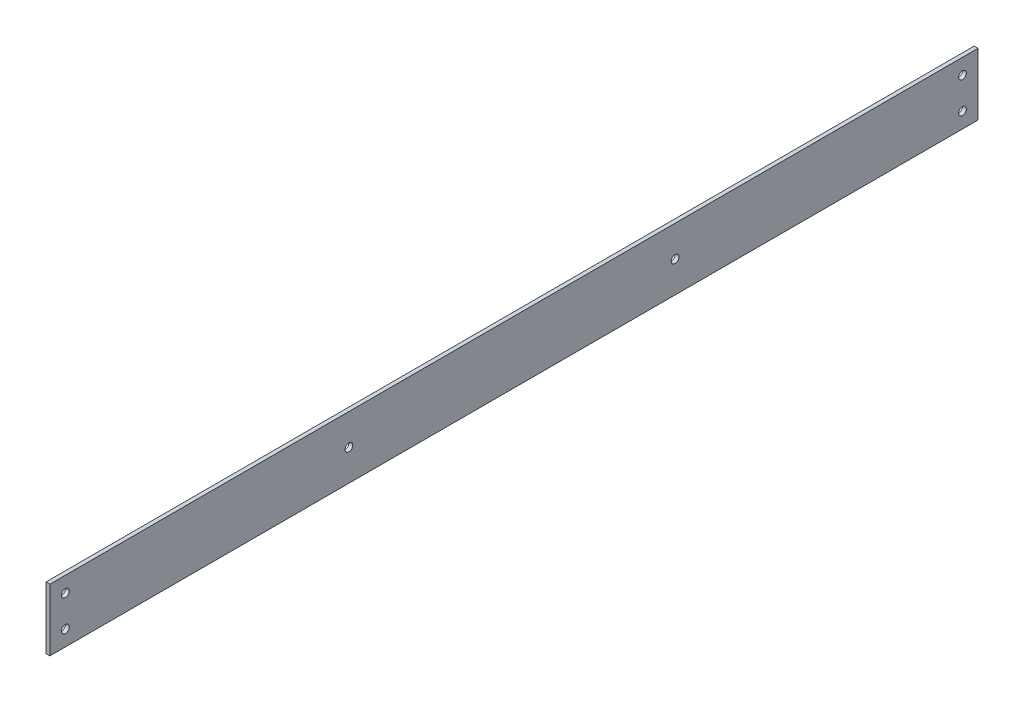
ISO-10303-21;
HEADER;
FILE_DESCRIPTION(('STEP AP214'),'2;1');
FILE_NAME('part.step','',(''),(''),'','','');
FILE_SCHEMA(('AUTOMOTIVE_DESIGN { 1 0 10303 214 1 1 1 1 }'));
ENDSEC;
DATA;
#1=APPLICATION_CONTEXT('core data for automotive mechanical design processes');
#2=APPLICATION_PROTOCOL_DEFINITION('international standard','automotive_design',2000,#1);
#3=PRODUCT_CONTEXT('',#1,'mechanical');
#4=PRODUCT('Part','Part','',(#3));
#5=PRODUCT_RELATED_PRODUCT_CATEGORY('part','',(#4));
#6=PRODUCT_DEFINITION_FORMATION('','',#4);
#7=PRODUCT_DEFINITION_CONTEXT('part definition',#1,'design');
#8=PRODUCT_DEFINITION('design','',#6,#7);
#9=PRODUCT_DEFINITION_SHAPE('','',#8);
#10=(LENGTH_UNIT() NAMED_UNIT(*) SI_UNIT(.MILLI.,.METRE.));
#11=(NAMED_UNIT(*) PLANE_ANGLE_UNIT() SI_UNIT($,.RADIAN.));
#12=(NAMED_UNIT(*) SI_UNIT($,.STERADIAN.) SOLID_ANGLE_UNIT());
#13=UNCERTAINTY_MEASURE_WITH_UNIT(LENGTH_MEASURE(1.E-05),#10,'distance_accuracy_value','');
#14=(GEOMETRIC_REPRESENTATION_CONTEXT(3) GLOBAL_UNCERTAINTY_ASSIGNED_CONTEXT((#13)) GLOBAL_UNIT_ASSIGNED_CONTEXT((#10,
#11,#12)) REPRESENTATION_CONTEXT('',''));
#15=CARTESIAN_POINT('',(0.,0.,0.));
#16=DIRECTION('',(0.,0.,1.));
#17=DIRECTION('',(1.,0.,0.));
#18=AXIS2_PLACEMENT_3D('',#15,#16,#17);
#19=CARTESIAN_POINT('',(1.5875,-25.4,809.625));
#20=DIRECTION('',(-1.,0.,0.));
#21=DIRECTION('',(0.,0.,1.));
#22=AXIS2_PLACEMENT_3D('',#19,#20,#21);
#23=PLANE('',#22);
#24=CARTESIAN_POINT('',(1.5875,0.,273.05));
#25=DIRECTION('',(-1.,0.,0.));
#26=DIRECTION('',(0.,0.,1.));
#27=AXIS2_PLACEMENT_3D('',#24,#25,#26);
#28=CIRCLE('',#27,3.17499999999997);
#29=CARTESIAN_POINT('',(1.5875,0.,276.225));
#30=VERTEX_POINT('',#29);
#31=EDGE_CURVE('E95',#30,#30,#28,.T.);
#32=ORIENTED_EDGE('',*,*,#31,.T.);
#33=EDGE_LOOP('',(#32));
#34=FACE_BOUND('',#33,.T.);
#35=CARTESIAN_POINT('',(1.5875,0.,539.75));
#36=DIRECTION('',(-1.,0.,0.));
#37=DIRECTION('',(0.,0.,1.));
#38=AXIS2_PLACEMENT_3D('',#35,#36,#37);
#39=CIRCLE('',#38,3.17499999999997);
#40=CARTESIAN_POINT('',(1.5875,0.,542.925));
#41=VERTEX_POINT('',#40);
#42=EDGE_CURVE('E162',#41,#41,#39,.T.);
#43=ORIENTED_EDGE('',*,*,#42,.T.);
#44=EDGE_LOOP('',(#43));
#45=FACE_BOUND('',#44,.T.);
#46=CARTESIAN_POINT('',(1.5875,-12.7,38.1));
#47=DIRECTION('',(1.,0.,0.));
#48=DIRECTION('',(0.,0.,-1.));
#49=AXIS2_PLACEMENT_3D('',#46,#47,#48);
#50=CIRCLE('',#49,3.175);
#51=CARTESIAN_POINT('',(1.5875,-12.7,34.925));
#52=VERTEX_POINT('',#51);
#53=EDGE_CURVE('E111',#52,#52,#50,.T.);
#54=ORIENTED_EDGE('',*,*,#53,.F.);
#55=EDGE_LOOP('',(#54));
#56=FACE_BOUND('',#55,.T.);
#57=CARTESIAN_POINT('',(1.5875,12.7,771.525));
#58=DIRECTION('',(1.,0.,0.));
#59=DIRECTION('',(0.,0.,1.));
#60=AXIS2_PLACEMENT_3D('',#57,#58,#59);
#61=CIRCLE('',#60,3.17500000000008);
#62=CARTESIAN_POINT('',(1.5875,12.7,774.7));
#63=VERTEX_POINT('',#62);
#64=EDGE_CURVE('E103',#63,#63,#61,.T.);
#65=ORIENTED_EDGE('',*,*,#64,.F.);
#66=EDGE_LOOP('',(#65));
#67=FACE_BOUND('',#66,.T.);
#68=CARTESIAN_POINT('',(1.5875,-12.7,771.525));
#69=DIRECTION('',(1.,0.,0.));
#70=DIRECTION('',(0.,0.,1.));
#71=AXIS2_PLACEMENT_3D('',#68,#69,#70);
#72=CIRCLE('',#71,3.17499999999986);
#73=CARTESIAN_POINT('',(1.5875,-12.7,774.7));
#74=VERTEX_POINT('',#73);
#75=EDGE_CURVE('E104',#74,#74,#72,.T.);
#76=ORIENTED_EDGE('',*,*,#75,.F.);
#77=EDGE_LOOP('',(#76));
#78=FACE_BOUND('',#77,.T.);
#79=CARTESIAN_POINT('',(1.5875,12.7,38.1));
#80=DIRECTION('',(1.,0.,0.));
#81=DIRECTION('',(0.,0.,-1.));
#82=AXIS2_PLACEMENT_3D('',#79,#80,#81);
#83=CIRCLE('',#82,3.175);
#84=CARTESIAN_POINT('',(1.5875,12.7,34.925));
#85=VERTEX_POINT('',#84);
#86=EDGE_CURVE('E110',#85,#85,#83,.T.);
#87=ORIENTED_EDGE('',*,*,#86,.F.);
#88=EDGE_LOOP('',(#87));
#89=FACE_BOUND('',#88,.T.);
#90=DIRECTION('',(0.,0.,-1.));
#91=VECTOR('',#90,1.);
#92=CARTESIAN_POINT('',(1.5875,25.4,809.625));
#93=LINE('',#92,#91);
#94=CARTESIAN_POINT('',(1.5875,25.4,784.225));
#95=VERTEX_POINT('',#94);
#96=CARTESIAN_POINT('',(1.5875,25.4,25.4));
#97=VERTEX_POINT('',#96);
#98=EDGE_CURVE('E11',#95,#97,#93,.T.);
#99=ORIENTED_EDGE('',*,*,#98,.F.);
#100=DIRECTION('',(0.,-1.,0.));
#101=VECTOR('',#100,1.);
#102=CARTESIAN_POINT('',(1.5875,-25.4,784.225));
#103=LINE('',#102,#101);
#104=CARTESIAN_POINT('',(1.5875,-25.4,784.225));
#105=VERTEX_POINT('',#104);
#106=EDGE_CURVE('E73',#95,#105,#103,.T.);
#107=ORIENTED_EDGE('',*,*,#106,.T.);
#108=DIRECTION('',(0.,0.,-1.));
#109=VECTOR('',#108,1.);
#110=CARTESIAN_POINT('',(1.5875,-25.4,809.625));
#111=LINE('',#110,#109);
#112=CARTESIAN_POINT('',(1.5875,-25.4,25.4));
#113=VERTEX_POINT('',#112);
#114=EDGE_CURVE('E89',#105,#113,#111,.T.);
#115=ORIENTED_EDGE('',*,*,#114,.T.);
#116=DIRECTION('',(0.,1.,0.));
#117=VECTOR('',#116,1.);
#118=CARTESIAN_POINT('',(1.5875,-25.4,25.4));
#119=LINE('',#118,#117);
#120=EDGE_CURVE('E57',#113,#97,#119,.T.);
#121=ORIENTED_EDGE('',*,*,#120,.T.);
#122=EDGE_LOOP('',(#99,#107,#115,#121));
#123=FACE_BOUND('',#122,.T.);
#124=ADVANCED_FACE('F35',(#34,#45,#56,#67,#78,#89,#123),#23,.F.);
#125=CARTESIAN_POINT('',(-1.5875,25.4,809.625));
#126=DIRECTION('',(0.,-1.,0.));
#127=DIRECTION('',(0.,0.,-1.));
#128=AXIS2_PLACEMENT_3D('',#125,#126,#127);
#129=PLANE('',#128);
#130=DIRECTION('',(0.,0.,-1.));
#131=VECTOR('',#130,1.);
#132=CARTESIAN_POINT('',(-1.5875,25.4,809.625));
#133=LINE('',#132,#131);
#134=CARTESIAN_POINT('',(-1.5875,25.4,784.225));
#135=VERTEX_POINT('',#134);
#136=CARTESIAN_POINT('',(-1.5875,25.4,25.4));
#137=VERTEX_POINT('',#136);
#138=EDGE_CURVE('E42',#135,#137,#133,.T.);
#139=ORIENTED_EDGE('',*,*,#138,.F.);
#140=DIRECTION('',(-1.,0.,0.));
#141=VECTOR('',#140,1.);
#142=CARTESIAN_POINT('',(1.5875,25.4,784.225));
#143=LINE('',#142,#141);
#144=EDGE_CURVE('E76',#95,#135,#143,.T.);
#145=ORIENTED_EDGE('',*,*,#144,.F.);
#146=ORIENTED_EDGE('',*,*,#98,.T.);
#147=DIRECTION('',(-1.,0.,0.));
#148=VECTOR('',#147,1.);
#149=CARTESIAN_POINT('',(1.5875,25.4,25.4));
#150=LINE('',#149,#148);
#151=EDGE_CURVE('E93',#97,#137,#150,.T.);
#152=ORIENTED_EDGE('',*,*,#151,.T.);
#153=EDGE_LOOP('',(#139,#145,#146,#152));
#154=FACE_BOUND('',#153,.T.);
#155=ADVANCED_FACE('F85',(#154),#129,.F.);
#156=CARTESIAN_POINT('',(-1.5875,-25.4,809.625));
#157=DIRECTION('',(1.,0.,0.));
#158=DIRECTION('',(0.,0.,-1.));
#159=AXIS2_PLACEMENT_3D('',#156,#157,#158);
#160=PLANE('',#159);
#161=CARTESIAN_POINT('',(-1.5875,0.,273.05));
#162=DIRECTION('',(-1.,0.,0.));
#163=DIRECTION('',(0.,0.,1.));
#164=AXIS2_PLACEMENT_3D('',#161,#162,#163);
#165=CIRCLE('',#164,3.17499999999997);
#166=CARTESIAN_POINT('',(-1.5875,0.,276.225));
#167=VERTEX_POINT('',#166);
#168=EDGE_CURVE('E193',#167,#167,#165,.T.);
#169=ORIENTED_EDGE('',*,*,#168,.F.);
#170=EDGE_LOOP('',(#169));
#171=FACE_BOUND('',#170,.T.);
#172=CARTESIAN_POINT('',(-1.5875,0.,539.75));
#173=DIRECTION('',(-1.,0.,0.));
#174=DIRECTION('',(0.,0.,1.));
#175=AXIS2_PLACEMENT_3D('',#172,#173,#174);
#176=CIRCLE('',#175,3.17499999999997);
#177=CARTESIAN_POINT('',(-1.5875,0.,542.925));
#178=VERTEX_POINT('',#177);
#179=EDGE_CURVE('E197',#178,#178,#176,.T.);
#180=ORIENTED_EDGE('',*,*,#179,.F.);
#181=EDGE_LOOP('',(#180));
#182=FACE_BOUND('',#181,.T.);
#183=CARTESIAN_POINT('',(-1.5875,-12.7,38.1));
#184=DIRECTION('',(1.,0.,0.));
#185=DIRECTION('',(0.,0.,-1.));
#186=AXIS2_PLACEMENT_3D('',#183,#184,#185);
#187=CIRCLE('',#186,3.175);
#188=CARTESIAN_POINT('',(-1.5875,-12.7,34.925));
#189=VERTEX_POINT('',#188);
#190=EDGE_CURVE('E107',#189,#189,#187,.T.);
#191=ORIENTED_EDGE('',*,*,#190,.T.);
#192=EDGE_LOOP('',(#191));
#193=FACE_BOUND('',#192,.T.);
#194=CARTESIAN_POINT('',(-1.5875,12.7,771.525));
#195=DIRECTION('',(1.,0.,0.));
#196=DIRECTION('',(0.,0.,1.));
#197=AXIS2_PLACEMENT_3D('',#194,#195,#196);
#198=CIRCLE('',#197,3.17500000000008);
#199=CARTESIAN_POINT('',(-1.5875,12.7,774.7));
#200=VERTEX_POINT('',#199);
#201=EDGE_CURVE('E114',#200,#200,#198,.T.);
#202=ORIENTED_EDGE('',*,*,#201,.T.);
#203=EDGE_LOOP('',(#202));
#204=FACE_BOUND('',#203,.T.);
#205=CARTESIAN_POINT('',(-1.5875,-12.7,771.525));
#206=DIRECTION('',(1.,0.,0.));
#207=DIRECTION('',(0.,0.,1.));
#208=AXIS2_PLACEMENT_3D('',#205,#206,#207);
#209=CIRCLE('',#208,3.17499999999986);
#210=CARTESIAN_POINT('',(-1.5875,-12.7,774.7));
#211=VERTEX_POINT('',#210);
#212=EDGE_CURVE('E100',#211,#211,#209,.T.);
#213=ORIENTED_EDGE('',*,*,#212,.T.);
#214=EDGE_LOOP('',(#213));
#215=FACE_BOUND('',#214,.T.);
#216=CARTESIAN_POINT('',(-1.5875,12.7,38.1));
#217=DIRECTION('',(1.,0.,0.));
#218=DIRECTION('',(0.,0.,-1.));
#219=AXIS2_PLACEMENT_3D('',#216,#217,#218);
#220=CIRCLE('',#219,3.175);
#221=CARTESIAN_POINT('',(-1.5875,12.7,34.925));
#222=VERTEX_POINT('',#221);
#223=EDGE_CURVE('E119',#222,#222,#220,.T.);
#224=ORIENTED_EDGE('',*,*,#223,.T.);
#225=EDGE_LOOP('',(#224));
#226=FACE_BOUND('',#225,.T.);
#227=DIRECTION('',(0.,0.,-1.));
#228=VECTOR('',#227,1.);
#229=CARTESIAN_POINT('',(-1.5875,-25.4,809.625));
#230=LINE('',#229,#228);
#231=CARTESIAN_POINT('',(-1.5875,-25.4,784.225));
#232=VERTEX_POINT('',#231);
#233=CARTESIAN_POINT('',(-1.5875,-25.4,25.4));
#234=VERTEX_POINT('',#233);
#235=EDGE_CURVE('E125',#232,#234,#230,.T.);
#236=ORIENTED_EDGE('',*,*,#235,.F.);
#237=DIRECTION('',(0.,-1.,0.));
#238=VECTOR('',#237,1.);
#239=CARTESIAN_POINT('',(-1.5875,-25.4,784.225));
#240=LINE('',#239,#238);
#241=EDGE_CURVE('E49',#135,#232,#240,.T.);
#242=ORIENTED_EDGE('',*,*,#241,.F.);
#243=ORIENTED_EDGE('',*,*,#138,.T.);
#244=DIRECTION('',(0.,1.,0.));
#245=VECTOR('',#244,1.);
#246=CARTESIAN_POINT('',(-1.5875,-25.4,25.4));
#247=LINE('',#246,#245);
#248=EDGE_CURVE('E91',#234,#137,#247,.T.);
#249=ORIENTED_EDGE('',*,*,#248,.F.);
#250=EDGE_LOOP('',(#236,#242,#243,#249));
#251=FACE_BOUND('',#250,.T.);
#252=ADVANCED_FACE('F130',(#171,#182,#193,#204,#215,#226,#251),#160,.F.);
#253=CARTESIAN_POINT('',(-1.5875,-25.4,809.625));
#254=DIRECTION('',(0.,1.,0.));
#255=DIRECTION('',(0.,0.,1.));
#256=AXIS2_PLACEMENT_3D('',#253,#254,#255);
#257=PLANE('',#256);
#258=ORIENTED_EDGE('',*,*,#114,.F.);
#259=DIRECTION('',(-1.,0.,0.));
#260=VECTOR('',#259,1.);
#261=CARTESIAN_POINT('',(1.5875,-25.4,784.225));
#262=LINE('',#261,#260);
#263=EDGE_CURVE('E77',#105,#232,#262,.T.);
#264=ORIENTED_EDGE('',*,*,#263,.T.);
#265=ORIENTED_EDGE('',*,*,#235,.T.);
#266=DIRECTION('',(-1.,0.,0.));
#267=VECTOR('',#266,1.);
#268=CARTESIAN_POINT('',(1.5875,-25.4,25.4));
#269=LINE('',#268,#267);
#270=EDGE_CURVE('E90',#113,#234,#269,.T.);
#271=ORIENTED_EDGE('',*,*,#270,.F.);
#272=EDGE_LOOP('',(#258,#264,#265,#271));
#273=FACE_BOUND('',#272,.T.);
#274=ADVANCED_FACE('F134',(#273),#257,.F.);
#275=CARTESIAN_POINT('',(-1.5875,12.7,38.1));
#276=DIRECTION('',(1.,0.,0.));
#277=DIRECTION('',(0.,0.,-1.));
#278=AXIS2_PLACEMENT_3D('',#275,#276,#277);
#279=CYLINDRICAL_SURFACE('',#278,3.175);
#280=ORIENTED_EDGE('',*,*,#223,.F.);
#281=EDGE_LOOP('',(#280));
#282=FACE_BOUND('',#281,.T.);
#283=ORIENTED_EDGE('',*,*,#86,.T.);
#284=EDGE_LOOP('',(#283));
#285=FACE_BOUND('',#284,.T.);
#286=ADVANCED_FACE('F171',(#282,#285),#279,.F.);
#287=CARTESIAN_POINT('',(-1.5875,-12.7,771.525));
#288=DIRECTION('',(1.,0.,0.));
#289=DIRECTION('',(0.,0.,-1.));
#290=AXIS2_PLACEMENT_3D('',#287,#288,#289);
#291=CYLINDRICAL_SURFACE('',#290,3.17499999999986);
#292=ORIENTED_EDGE('',*,*,#212,.F.);
#293=EDGE_LOOP('',(#292));
#294=FACE_BOUND('',#293,.T.);
#295=ORIENTED_EDGE('',*,*,#75,.T.);
#296=EDGE_LOOP('',(#295));
#297=FACE_BOUND('',#296,.T.);
#298=ADVANCED_FACE('F173',(#294,#297),#291,.F.);
#299=CARTESIAN_POINT('',(-1.5875,12.7,771.525));
#300=DIRECTION('',(1.,0.,0.));
#301=DIRECTION('',(0.,0.,-1.));
#302=AXIS2_PLACEMENT_3D('',#299,#300,#301);
#303=CYLINDRICAL_SURFACE('',#302,3.17500000000008);
#304=ORIENTED_EDGE('',*,*,#201,.F.);
#305=EDGE_LOOP('',(#304));
#306=FACE_BOUND('',#305,.T.);
#307=ORIENTED_EDGE('',*,*,#64,.T.);
#308=EDGE_LOOP('',(#307));
#309=FACE_BOUND('',#308,.T.);
#310=ADVANCED_FACE('F145',(#306,#309),#303,.F.);
#311=CARTESIAN_POINT('',(-1.5875,-12.7,38.1));
#312=DIRECTION('',(1.,0.,0.));
#313=DIRECTION('',(0.,0.,-1.));
#314=AXIS2_PLACEMENT_3D('',#311,#312,#313);
#315=CYLINDRICAL_SURFACE('',#314,3.175);
#316=ORIENTED_EDGE('',*,*,#190,.F.);
#317=EDGE_LOOP('',(#316));
#318=FACE_BOUND('',#317,.T.);
#319=ORIENTED_EDGE('',*,*,#53,.T.);
#320=EDGE_LOOP('',(#319));
#321=FACE_BOUND('',#320,.T.);
#322=ADVANCED_FACE('F137',(#318,#321),#315,.F.);
#323=CARTESIAN_POINT('',(1.5875,-25.4,25.4));
#324=DIRECTION('',(0.,0.,1.));
#325=DIRECTION('',(0.,-1.,0.));
#326=AXIS2_PLACEMENT_3D('',#323,#324,#325);
#327=PLANE('',#326);
#328=ORIENTED_EDGE('',*,*,#248,.T.);
#329=ORIENTED_EDGE('',*,*,#151,.F.);
#330=ORIENTED_EDGE('',*,*,#120,.F.);
#331=ORIENTED_EDGE('',*,*,#270,.T.);
#332=EDGE_LOOP('',(#328,#329,#330,#331));
#333=FACE_BOUND('',#332,.T.);
#334=ADVANCED_FACE('F135',(#333),#327,.F.);
#335=CARTESIAN_POINT('',(1.5875,-25.4,784.225));
#336=DIRECTION('',(0.,0.,-1.));
#337=DIRECTION('',(-1.,0.,0.));
#338=AXIS2_PLACEMENT_3D('',#335,#336,#337);
#339=PLANE('',#338);
#340=ORIENTED_EDGE('',*,*,#241,.T.);
#341=ORIENTED_EDGE('',*,*,#263,.F.);
#342=ORIENTED_EDGE('',*,*,#106,.F.);
#343=ORIENTED_EDGE('',*,*,#144,.T.);
#344=EDGE_LOOP('',(#340,#341,#342,#343));
#345=FACE_BOUND('',#344,.T.);
#346=ADVANCED_FACE('F75',(#345),#339,.F.);
#347=CARTESIAN_POINT('',(1.5875,0.,539.75));
#348=DIRECTION('',(-1.,0.,0.));
#349=DIRECTION('',(0.,0.,1.));
#350=AXIS2_PLACEMENT_3D('',#347,#348,#349);
#351=CYLINDRICAL_SURFACE('',#350,3.17499999999997);
#352=ORIENTED_EDGE('',*,*,#42,.F.);
#353=EDGE_LOOP('',(#352));
#354=FACE_BOUND('',#353,.T.);
#355=ORIENTED_EDGE('',*,*,#179,.T.);
#356=EDGE_LOOP('',(#355));
#357=FACE_BOUND('',#356,.T.);
#358=ADVANCED_FACE('F143',(#354,#357),#351,.F.);
#359=CARTESIAN_POINT('',(1.5875,0.,273.05));
#360=DIRECTION('',(-1.,0.,0.));
#361=DIRECTION('',(0.,0.,1.));
#362=AXIS2_PLACEMENT_3D('',#359,#360,#361);
#363=CYLINDRICAL_SURFACE('',#362,3.17499999999997);
#364=ORIENTED_EDGE('',*,*,#31,.F.);
#365=EDGE_LOOP('',(#364));
#366=FACE_BOUND('',#365,.T.);
#367=ORIENTED_EDGE('',*,*,#168,.T.);
#368=EDGE_LOOP('',(#367));
#369=FACE_BOUND('',#368,.T.);
#370=ADVANCED_FACE('F240',(#366,#369),#363,.F.);
#371=CLOSED_SHELL('',(#124,#155,#252,#274,#286,#298,#310,#322,#334,#346,#358,#370));
#372=MANIFOLD_SOLID_BREP('B2',#371);
#373=ADVANCED_BREP_SHAPE_REPRESENTATION('',(#18,#372),#14);
#374=SHAPE_DEFINITION_REPRESENTATION(#9,#373);
ENDSEC;
END-ISO-10303-21;
